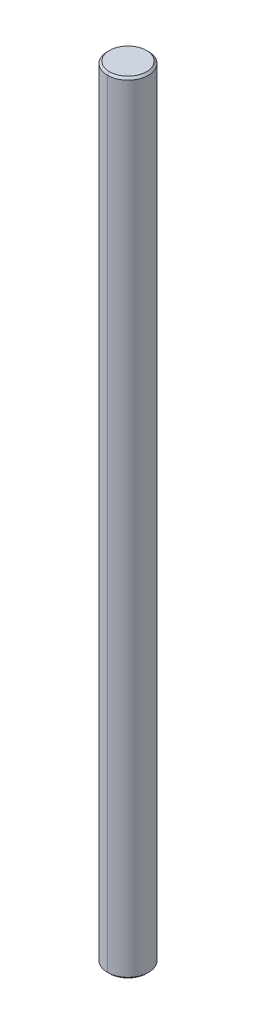
ISO-10303-21;
HEADER;
FILE_DESCRIPTION(('STEP AP214'),'2;1');
FILE_NAME('part.step','',(''),(''),'','','');
FILE_SCHEMA(('AUTOMOTIVE_DESIGN { 1 0 10303 214 1 1 1 1 }'));
ENDSEC;
DATA;
#1=APPLICATION_CONTEXT('core data for automotive mechanical design processes');
#2=APPLICATION_PROTOCOL_DEFINITION('international standard','automotive_design',2000,#1);
#3=PRODUCT_CONTEXT('',#1,'mechanical');
#4=PRODUCT('Part','Part','',(#3));
#5=PRODUCT_RELATED_PRODUCT_CATEGORY('part','',(#4));
#6=PRODUCT_DEFINITION_FORMATION('','',#4);
#7=PRODUCT_DEFINITION_CONTEXT('part definition',#1,'design');
#8=PRODUCT_DEFINITION('design','',#6,#7);
#9=PRODUCT_DEFINITION_SHAPE('','',#8);
#10=(LENGTH_UNIT() NAMED_UNIT(*) SI_UNIT(.MILLI.,.METRE.));
#11=(NAMED_UNIT(*) PLANE_ANGLE_UNIT() SI_UNIT($,.RADIAN.));
#12=(NAMED_UNIT(*) SI_UNIT($,.STERADIAN.) SOLID_ANGLE_UNIT());
#13=UNCERTAINTY_MEASURE_WITH_UNIT(LENGTH_MEASURE(1.E-05),#10,'distance_accuracy_value','');
#14=(GEOMETRIC_REPRESENTATION_CONTEXT(3) GLOBAL_UNCERTAINTY_ASSIGNED_CONTEXT((#13)) GLOBAL_UNIT_ASSIGNED_CONTEXT((#10,
#11,#12)) REPRESENTATION_CONTEXT('',''));
#15=CARTESIAN_POINT('',(0.,0.,0.));
#16=DIRECTION('',(0.,0.,1.));
#17=DIRECTION('',(1.,0.,0.));
#18=AXIS2_PLACEMENT_3D('',#15,#16,#17);
#19=CARTESIAN_POINT('',(-2.044407817928,12.612134028806,4.935145607862));
#20=DIRECTION('',(0.,-1.,0.));
#21=DIRECTION('',(0.,0.,-1.));
#22=AXIS2_PLACEMENT_3D('',#19,#20,#21);
#23=CONICAL_SURFACE('',#22,0.9,0.785398163397443);
#24=DIRECTION('',(0.,-0.707106781186551,0.707106781186545));
#25=VECTOR('',#24,1.);
#26=CARTESIAN_POINT('',(-2.044407817928,12.612134028806,5.835145607862));
#27=LINE('',#26,#25);
#28=CARTESIAN_POINT('',(-2.044407817928,12.612134028806,5.835145607862));
#29=VERTEX_POINT('',#28);
#30=CARTESIAN_POINT('',(-2.044407817928,12.512134028806,5.935145607862));
#31=VERTEX_POINT('',#30);
#32=EDGE_CURVE('E103',#29,#31,#27,.T.);
#33=ORIENTED_EDGE('',*,*,#32,.F.);
#34=CARTESIAN_POINT('',(-2.044407817928,12.612134028806,4.935145607862));
#35=DIRECTION('',(0.,1.,0.));
#36=DIRECTION('',(0.,0.,1.));
#37=AXIS2_PLACEMENT_3D('',#34,#35,#36);
#38=CIRCLE('',#37,0.9);
#39=CARTESIAN_POINT('',(-2.044407817928,12.612134028806,4.035145607862));
#40=VERTEX_POINT('',#39);
#41=EDGE_CURVE('E26',#40,#29,#38,.T.);
#42=ORIENTED_EDGE('',*,*,#41,.F.);
#43=DIRECTION('',(0.,-0.707106781186551,-0.707106781186545));
#44=VECTOR('',#43,1.);
#45=CARTESIAN_POINT('',(-2.044407817928,12.612134028806,4.035145607862));
#46=LINE('',#45,#44);
#47=CARTESIAN_POINT('',(-2.044407817928,12.512134028806,3.935145607862));
#48=VERTEX_POINT('',#47);
#49=EDGE_CURVE('E96',#40,#48,#46,.T.);
#50=ORIENTED_EDGE('',*,*,#49,.T.);
#51=CARTESIAN_POINT('',(-2.044407817928,12.512134028806,4.935145607862));
#52=DIRECTION('',(0.,-1.,0.));
#53=DIRECTION('',(0.,0.,1.));
#54=AXIS2_PLACEMENT_3D('',#51,#52,#53);
#55=CIRCLE('',#54,1.);
#56=EDGE_CURVE('E73',#31,#48,#55,.T.);
#57=ORIENTED_EDGE('',*,*,#56,.F.);
#58=EDGE_LOOP('',(#33,#42,#50,#57));
#59=FACE_BOUND('',#58,.T.);
#60=ADVANCED_FACE('F16',(#59),#23,.T.);
#61=CARTESIAN_POINT('',(-2.044407817928,-25.287865971194,4.935145607862));
#62=DIRECTION('',(0.,1.,0.));
#63=DIRECTION('',(0.,0.,1.));
#64=AXIS2_PLACEMENT_3D('',#61,#62,#63);
#65=CONICAL_SURFACE('',#64,1.,0.785398163397479);
#66=DIRECTION('',(0.,0.707106781186526,-0.707106781186569));
#67=VECTOR('',#66,1.);
#68=CARTESIAN_POINT('',(-2.044407817928,-25.287865971194,3.935145607862));
#69=LINE('',#68,#67);
#70=CARTESIAN_POINT('',(-2.044407817928,-25.387865971194,4.035145607862));
#71=VERTEX_POINT('',#70);
#72=CARTESIAN_POINT('',(-2.044407817928,-25.287865971194,3.935145607862));
#73=VERTEX_POINT('',#72);
#74=EDGE_CURVE('E20',#71,#73,#69,.T.);
#75=ORIENTED_EDGE('',*,*,#74,.F.);
#76=CARTESIAN_POINT('',(-2.044407817928,-25.387865971194,4.935145607862));
#77=DIRECTION('',(0.,-1.,0.));
#78=DIRECTION('',(0.,0.,1.));
#79=AXIS2_PLACEMENT_3D('',#76,#77,#78);
#80=CIRCLE('',#79,0.9);
#81=CARTESIAN_POINT('',(-2.044407817928,-25.387865971194,5.835145607862));
#82=VERTEX_POINT('',#81);
#83=EDGE_CURVE('E10',#82,#71,#80,.T.);
#84=ORIENTED_EDGE('',*,*,#83,.F.);
#85=DIRECTION('',(0.,0.707106781186526,0.707106781186569));
#86=VECTOR('',#85,1.);
#87=CARTESIAN_POINT('',(-2.044407817928,-25.287865971194,5.935145607862));
#88=LINE('',#87,#86);
#89=CARTESIAN_POINT('',(-2.044407817928,-25.287865971194,5.935145607862));
#90=VERTEX_POINT('',#89);
#91=EDGE_CURVE('E118',#82,#90,#88,.T.);
#92=ORIENTED_EDGE('',*,*,#91,.T.);
#93=CARTESIAN_POINT('',(-2.044407817928,-25.287865971194,4.935145607862));
#94=DIRECTION('',(0.,1.,0.));
#95=DIRECTION('',(0.,0.,1.));
#96=AXIS2_PLACEMENT_3D('',#93,#94,#95);
#97=CIRCLE('',#96,1.);
#98=EDGE_CURVE('E40',#73,#90,#97,.T.);
#99=ORIENTED_EDGE('',*,*,#98,.F.);
#100=EDGE_LOOP('',(#75,#84,#92,#99));
#101=FACE_BOUND('',#100,.T.);
#102=ADVANCED_FACE('F18',(#101),#65,.T.);
#103=CARTESIAN_POINT('',(-2.044407817928,-25.387865971194,4.935145607862));
#104=DIRECTION('',(0.,1.,0.));
#105=DIRECTION('',(1.,0.,0.));
#106=AXIS2_PLACEMENT_3D('',#103,#104,#105);
#107=PLANE('',#106);
#108=ORIENTED_EDGE('',*,*,#83,.T.);
#109=CARTESIAN_POINT('',(-2.044407817928,-25.387865971194,4.935145607862));
#110=DIRECTION('',(0.,-1.,0.));
#111=DIRECTION('',(0.,0.,1.));
#112=AXIS2_PLACEMENT_3D('',#109,#110,#111);
#113=CIRCLE('',#112,0.9);
#114=EDGE_CURVE('E101',#71,#82,#113,.T.);
#115=ORIENTED_EDGE('',*,*,#114,.T.);
#116=EDGE_LOOP('',(#108,#115));
#117=FACE_BOUND('',#116,.T.);
#118=ADVANCED_FACE('F138',(#117),#107,.F.);
#119=CARTESIAN_POINT('',(-2.044407817928,12.612134028806,4.935145607862));
#120=DIRECTION('',(0.,1.,0.));
#121=DIRECTION('',(1.,0.,0.));
#122=AXIS2_PLACEMENT_3D('',#119,#120,#121);
#123=PLANE('',#122);
#124=ORIENTED_EDGE('',*,*,#41,.T.);
#125=CARTESIAN_POINT('',(-2.044407817928,12.612134028806,4.935145607862));
#126=DIRECTION('',(0.,1.,0.));
#127=DIRECTION('',(0.,0.,1.));
#128=AXIS2_PLACEMENT_3D('',#125,#126,#127);
#129=CIRCLE('',#128,0.9);
#130=EDGE_CURVE('E110',#29,#40,#129,.T.);
#131=ORIENTED_EDGE('',*,*,#130,.T.);
#132=EDGE_LOOP('',(#124,#131));
#133=FACE_BOUND('',#132,.T.);
#134=ADVANCED_FACE('F140',(#133),#123,.T.);
#135=CARTESIAN_POINT('',(-2.044407817928,12.612134028806,4.935145607862));
#136=DIRECTION('',(0.,-1.,0.));
#137=DIRECTION('',(0.,0.,-1.));
#138=AXIS2_PLACEMENT_3D('',#135,#136,#137);
#139=CYLINDRICAL_SURFACE('',#138,1.);
#140=DIRECTION('',(0.,-1.,0.));
#141=VECTOR('',#140,1.);
#142=CARTESIAN_POINT('',(-2.044407817928,12.612134028806,5.935145607862));
#143=LINE('',#142,#141);
#144=EDGE_CURVE('E78',#31,#90,#143,.T.);
#145=ORIENTED_EDGE('',*,*,#144,.F.);
#146=ORIENTED_EDGE('',*,*,#56,.T.);
#147=DIRECTION('',(0.,-1.,0.));
#148=VECTOR('',#147,1.);
#149=CARTESIAN_POINT('',(-2.044407817928,12.612134028806,3.935145607862));
#150=LINE('',#149,#148);
#151=EDGE_CURVE('E76',#48,#73,#150,.T.);
#152=ORIENTED_EDGE('',*,*,#151,.T.);
#153=ORIENTED_EDGE('',*,*,#98,.T.);
#154=EDGE_LOOP('',(#145,#146,#152,#153));
#155=FACE_BOUND('',#154,.T.);
#156=ADVANCED_FACE('F75',(#155),#139,.T.);
#157=CARTESIAN_POINT('',(-2.044407817928,12.612134028806,4.935145607862));
#158=DIRECTION('',(0.,-1.,0.));
#159=DIRECTION('',(0.,0.,-1.));
#160=AXIS2_PLACEMENT_3D('',#157,#158,#159);
#161=CYLINDRICAL_SURFACE('',#160,1.);
#162=CARTESIAN_POINT('',(-2.044407817928,12.512134028806,4.935145607862));
#163=DIRECTION('',(0.,-1.,0.));
#164=DIRECTION('',(0.,0.,1.));
#165=AXIS2_PLACEMENT_3D('',#162,#163,#164);
#166=CIRCLE('',#165,1.);
#167=EDGE_CURVE('E88',#48,#31,#166,.T.);
#168=ORIENTED_EDGE('',*,*,#167,.T.);
#169=ORIENTED_EDGE('',*,*,#144,.T.);
#170=CARTESIAN_POINT('',(-2.044407817928,-25.287865971194,4.935145607862));
#171=DIRECTION('',(0.,1.,0.));
#172=DIRECTION('',(0.,0.,1.));
#173=AXIS2_PLACEMENT_3D('',#170,#171,#172);
#174=CIRCLE('',#173,1.);
#175=EDGE_CURVE('E91',#90,#73,#174,.T.);
#176=ORIENTED_EDGE('',*,*,#175,.T.);
#177=ORIENTED_EDGE('',*,*,#151,.F.);
#178=EDGE_LOOP('',(#168,#169,#176,#177));
#179=FACE_BOUND('',#178,.T.);
#180=ADVANCED_FACE('F86',(#179),#161,.T.);
#181=CARTESIAN_POINT('',(-2.044407817928,-25.287865971194,4.935145607862));
#182=DIRECTION('',(0.,1.,0.));
#183=DIRECTION('',(0.,0.,1.));
#184=AXIS2_PLACEMENT_3D('',#181,#182,#183);
#185=CONICAL_SURFACE('',#184,1.,0.785398163397479);
#186=ORIENTED_EDGE('',*,*,#114,.F.);
#187=ORIENTED_EDGE('',*,*,#74,.T.);
#188=ORIENTED_EDGE('',*,*,#175,.F.);
#189=ORIENTED_EDGE('',*,*,#91,.F.);
#190=EDGE_LOOP('',(#186,#187,#188,#189));
#191=FACE_BOUND('',#190,.T.);
#192=ADVANCED_FACE('F135',(#191),#185,.T.);
#193=CARTESIAN_POINT('',(-2.044407817928,12.612134028806,4.935145607862));
#194=DIRECTION('',(0.,-1.,0.));
#195=DIRECTION('',(0.,0.,-1.));
#196=AXIS2_PLACEMENT_3D('',#193,#194,#195);
#197=CONICAL_SURFACE('',#196,0.9,0.785398163397443);
#198=ORIENTED_EDGE('',*,*,#130,.F.);
#199=ORIENTED_EDGE('',*,*,#32,.T.);
#200=ORIENTED_EDGE('',*,*,#167,.F.);
#201=ORIENTED_EDGE('',*,*,#49,.F.);
#202=EDGE_LOOP('',(#198,#199,#200,#201));
#203=FACE_BOUND('',#202,.T.);
#204=ADVANCED_FACE('F102',(#203),#197,.T.);
#205=CLOSED_SHELL('',(#60,#102,#118,#134,#156,#180,#192,#204));
#206=MANIFOLD_SOLID_BREP('B1',#205);
#207=ADVANCED_BREP_SHAPE_REPRESENTATION('',(#18,#206),#14);
#208=SHAPE_DEFINITION_REPRESENTATION(#9,#207);
ENDSEC;
END-ISO-10303-21;
